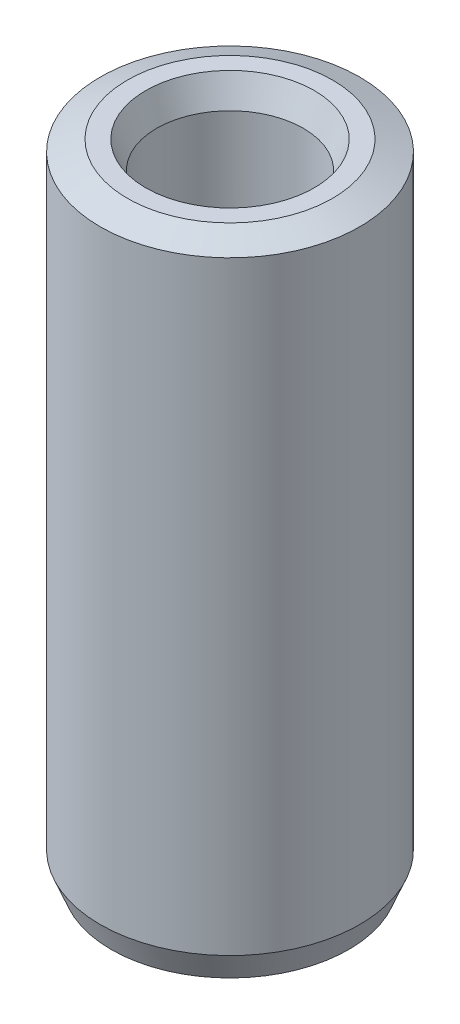
ISO-10303-21;
HEADER;
FILE_DESCRIPTION(('STEP AP214'),'2;1');
FILE_NAME('part.step','',(''),(''),'','','');
FILE_SCHEMA(('AUTOMOTIVE_DESIGN { 1 0 10303 214 1 1 1 1 }'));
ENDSEC;
DATA;
#1=APPLICATION_CONTEXT('core data for automotive mechanical design processes');
#2=APPLICATION_PROTOCOL_DEFINITION('international standard','automotive_design',2000,#1);
#3=PRODUCT_CONTEXT('',#1,'mechanical');
#4=PRODUCT('Part','Part','',(#3));
#5=PRODUCT_RELATED_PRODUCT_CATEGORY('part','',(#4));
#6=PRODUCT_DEFINITION_FORMATION('','',#4);
#7=PRODUCT_DEFINITION_CONTEXT('part definition',#1,'design');
#8=PRODUCT_DEFINITION('design','',#6,#7);
#9=PRODUCT_DEFINITION_SHAPE('','',#8);
#10=(LENGTH_UNIT() NAMED_UNIT(*) SI_UNIT(.MILLI.,.METRE.));
#11=(NAMED_UNIT(*) PLANE_ANGLE_UNIT() SI_UNIT($,.RADIAN.));
#12=(NAMED_UNIT(*) SI_UNIT($,.STERADIAN.) SOLID_ANGLE_UNIT());
#13=UNCERTAINTY_MEASURE_WITH_UNIT(LENGTH_MEASURE(1.E-05),#10,'distance_accuracy_value','');
#14=(GEOMETRIC_REPRESENTATION_CONTEXT(3) GLOBAL_UNCERTAINTY_ASSIGNED_CONTEXT((#13)) GLOBAL_UNIT_ASSIGNED_CONTEXT((#10,
#11,#12)) REPRESENTATION_CONTEXT('',''));
#15=CARTESIAN_POINT('',(0.,0.,0.));
#16=DIRECTION('',(0.,0.,1.));
#17=DIRECTION('',(1.,0.,0.));
#18=AXIS2_PLACEMENT_3D('',#15,#16,#17);
#19=CARTESIAN_POINT('',(0.,210.453476227582,0.));
#20=DIRECTION('',(0.,-1.,0.));
#21=DIRECTION('',(0.,0.,-1.));
#22=AXIS2_PLACEMENT_3D('',#19,#20,#21);
#23=CYLINDRICAL_SURFACE('',#22,42.5);
#24=CARTESIAN_POINT('',(0.,8.90464773771635,0.));
#25=DIRECTION('',(0.,1.,0.));
#26=DIRECTION('',(0.,0.,1.));
#27=AXIS2_PLACEMENT_3D('',#24,#25,#26);
#28=CIRCLE('',#27,42.5);
#29=CARTESIAN_POINT('',(0.,8.90464773771635,42.5));
#30=VERTEX_POINT('',#29);
#31=EDGE_CURVE('E10',#30,#30,#28,.T.);
#32=ORIENTED_EDGE('',*,*,#31,.T.);
#33=EDGE_LOOP('',(#32));
#34=FACE_BOUND('',#33,.T.);
#35=CARTESIAN_POINT('',(0.,206.84951135065,0.));
#36=DIRECTION('',(0.,1.,0.));
#37=DIRECTION('',(0.,0.,1.));
#38=AXIS2_PLACEMENT_3D('',#35,#36,#37);
#39=CIRCLE('',#38,42.5);
#40=CARTESIAN_POINT('',(0.,206.84951135065,-42.5));
#41=VERTEX_POINT('',#40);
#42=EDGE_CURVE('E50',#41,#41,#39,.F.);
#43=ORIENTED_EDGE('',*,*,#42,.T.);
#44=EDGE_LOOP('',(#43));
#45=FACE_BOUND('',#44,.T.);
#46=ADVANCED_FACE('F39',(#34,#45),#23,.T.);
#47=CARTESIAN_POINT('',(0.,210.453476227582,0.));
#48=DIRECTION('',(0.,1.,0.));
#49=DIRECTION('',(0.,0.,1.));
#50=AXIS2_PLACEMENT_3D('',#47,#48,#49);
#51=PLANE('',#50);
#52=CARTESIAN_POINT('',(0.,210.453476227582,0.));
#53=DIRECTION('',(0.,1.,0.));
#54=DIRECTION('',(0.,0.,1.));
#55=AXIS2_PLACEMENT_3D('',#52,#53,#54);
#56=CIRCLE('',#55,27.6134441037123);
#57=CARTESIAN_POINT('',(0.,210.453476227582,27.6134441037123));
#58=VERTEX_POINT('',#57);
#59=EDGE_CURVE('E58',#58,#58,#56,.F.);
#60=ORIENTED_EDGE('',*,*,#59,.T.);
#61=EDGE_LOOP('',(#60));
#62=FACE_BOUND('',#61,.T.);
#63=CARTESIAN_POINT('',(0.,210.453476227582,0.));
#64=DIRECTION('',(0.,1.,0.));
#65=DIRECTION('',(0.,0.,1.));
#66=AXIS2_PLACEMENT_3D('',#63,#64,#65);
#67=CIRCLE('',#66,33.5953522622835);
#68=CARTESIAN_POINT('',(0.,210.453476227582,-33.5953522622836));
#69=VERTEX_POINT('',#68);
#70=EDGE_CURVE('E61',#69,#69,#67,.T.);
#71=ORIENTED_EDGE('',*,*,#70,.T.);
#72=EDGE_LOOP('',(#71));
#73=FACE_BOUND('',#72,.T.);
#74=ADVANCED_FACE('F88',(#62,#73),#51,.T.);
#75=CARTESIAN_POINT('',(0.,0.,0.));
#76=DIRECTION('',(0.,1.,0.));
#77=DIRECTION('',(0.,0.,1.));
#78=AXIS2_PLACEMENT_3D('',#75,#76,#77);
#79=PLANE('',#78);
#80=CARTESIAN_POINT('',(0.,0.,0.));
#81=DIRECTION('',(0.,1.,0.));
#82=DIRECTION('',(0.,0.,1.));
#83=AXIS2_PLACEMENT_3D('',#80,#81,#82);
#84=CIRCLE('',#83,32.9141269644972);
#85=CARTESIAN_POINT('',(0.,0.,-32.9141269644972));
#86=VERTEX_POINT('',#85);
#87=EDGE_CURVE('E51',#86,#86,#84,.T.);
#88=ORIENTED_EDGE('',*,*,#87,.T.);
#89=EDGE_LOOP('',(#88));
#90=FACE_BOUND('',#89,.T.);
#91=CARTESIAN_POINT('',(0.,0.,0.));
#92=DIRECTION('',(0.,1.,0.));
#93=DIRECTION('',(0.,0.,1.));
#94=AXIS2_PLACEMENT_3D('',#91,#92,#93);
#95=CIRCLE('',#94,38.8960351230685);
#96=CARTESIAN_POINT('',(0.,0.,38.8960351230685));
#97=VERTEX_POINT('',#96);
#98=EDGE_CURVE('E54',#97,#97,#95,.F.);
#99=ORIENTED_EDGE('',*,*,#98,.T.);
#100=EDGE_LOOP('',(#99));
#101=FACE_BOUND('',#100,.T.);
#102=ADVANCED_FACE('F83',(#90,#101),#79,.F.);
#103=CARTESIAN_POINT('',(0.,210.453476227582,0.));
#104=DIRECTION('',(0.,-1.,0.));
#105=DIRECTION('',(0.,0.,-1.));
#106=AXIS2_PLACEMENT_3D('',#103,#104,#105);
#107=CYLINDRICAL_SURFACE('',#106,24.0094792267807);
#108=CARTESIAN_POINT('',(0.,201.548828489865,0.));
#109=DIRECTION('',(0.,1.,0.));
#110=DIRECTION('',(0.,0.,1.));
#111=AXIS2_PLACEMENT_3D('',#108,#109,#110);
#112=CIRCLE('',#111,24.0094792267807);
#113=CARTESIAN_POINT('',(0.,201.548828489865,24.0094792267807));
#114=VERTEX_POINT('',#113);
#115=EDGE_CURVE('E67',#114,#114,#112,.T.);
#116=ORIENTED_EDGE('',*,*,#115,.T.);
#117=EDGE_LOOP('',(#116));
#118=FACE_BOUND('',#117,.T.);
#119=CARTESIAN_POINT('',(0.,3.6039648769316,0.));
#120=DIRECTION('',(0.,1.,0.));
#121=DIRECTION('',(0.,0.,1.));
#122=AXIS2_PLACEMENT_3D('',#119,#120,#121);
#123=CIRCLE('',#122,24.0094792267807);
#124=CARTESIAN_POINT('',(0.,3.6039648769316,-24.0094792267807));
#125=VERTEX_POINT('',#124);
#126=EDGE_CURVE('E69',#125,#125,#123,.F.);
#127=ORIENTED_EDGE('',*,*,#126,.T.);
#128=EDGE_LOOP('',(#127));
#129=FACE_BOUND('',#128,.T.);
#130=ADVANCED_FACE('F71',(#118,#129),#107,.F.);
#131=CARTESIAN_POINT('',(0.,201.548828489865,0.));
#132=DIRECTION('',(0.,1.,0.));
#133=DIRECTION('',(0.,0.,1.));
#134=AXIS2_PLACEMENT_3D('',#131,#132,#133);
#135=CONICAL_SURFACE('',#134,24.0094792267807,0.384576027060333);
#136=ORIENTED_EDGE('',*,*,#59,.F.);
#137=EDGE_LOOP('',(#136));
#138=FACE_BOUND('',#137,.T.);
#139=ORIENTED_EDGE('',*,*,#115,.F.);
#140=EDGE_LOOP('',(#139));
#141=FACE_BOUND('',#140,.T.);
#142=ADVANCED_FACE('F77',(#138,#141),#135,.F.);
#143=CARTESIAN_POINT('',(0.,0.,0.));
#144=DIRECTION('',(0.,-1.,0.));
#145=DIRECTION('',(0.,0.,-1.));
#146=AXIS2_PLACEMENT_3D('',#143,#144,#145);
#147=CONICAL_SURFACE('',#146,32.9141269644972,1.18622029973456);
#148=CARTESIAN_POINT('',(0.,3.6039648769316,-24.0094792267807));
#149=CARTESIAN_POINT('',(0.,3.56642357613023,-24.1022359740486));
#150=CARTESIAN_POINT('',(0.,3.52888227532886,-24.1949927213165));
#151=CARTESIAN_POINT('',(0.,3.45379967372611,-24.3805062158522));
#152=CARTESIAN_POINT('',(0.,3.41625837292474,-24.4732629631201));
#153=CARTESIAN_POINT('',(0.,3.341175771322,-24.6587764576559));
#154=CARTESIAN_POINT('',(0.,3.30363447052063,-24.7515332049237));
#155=CARTESIAN_POINT('',(0.,3.22855186891789,-24.9370466994595));
#156=CARTESIAN_POINT('',(0.,3.19101056811652,-25.0298034467274));
#157=CARTESIAN_POINT('',(0.,3.11592796651378,-25.2153169412631));
#158=CARTESIAN_POINT('',(0.,3.07838666571241,-25.308073688531));
#159=CARTESIAN_POINT('',(0.,3.00330406410966,-25.4935871830668));
#160=CARTESIAN_POINT('',(0.,2.96576276330829,-25.5863439303347));
#161=CARTESIAN_POINT('',(0.,2.89068016170555,-25.7718574248704));
#162=CARTESIAN_POINT('',(0.,2.85313886090418,-25.8646141721383));
#163=CARTESIAN_POINT('',(0.,2.77805625930144,-26.0501276666741));
#164=CARTESIAN_POINT('',(0.,2.74051495850007,-26.1428844139419));
#165=CARTESIAN_POINT('',(0.,2.66543235689733,-26.3283979084777));
#166=CARTESIAN_POINT('',(0.,2.62789105609596,-26.4211546557456));
#167=CARTESIAN_POINT('',(0.,2.55280845449321,-26.6066681502813));
#168=CARTESIAN_POINT('',(0.,2.51526715369184,-26.6994248975492));
#169=CARTESIAN_POINT('',(0.,2.4401845520891,-26.884938392085));
#170=CARTESIAN_POINT('',(0.,2.40264325128773,-26.9776951393529));
#171=CARTESIAN_POINT('',(0.,2.32756064968499,-27.1632086338886));
#172=CARTESIAN_POINT('',(0.,2.29001934888362,-27.2559653811565));
#173=CARTESIAN_POINT('',(0.,2.21493674728088,-27.4414788756923));
#174=CARTESIAN_POINT('',(0.,2.17739544647951,-27.5342356229601));
#175=CARTESIAN_POINT('',(0.,2.10231284487677,-27.7197491174959));
#176=CARTESIAN_POINT('',(0.,2.06477154407539,-27.8125058647638));
#177=CARTESIAN_POINT('',(0.,1.98968894247265,-27.9980193592995));
#178=CARTESIAN_POINT('',(0.,1.95214764167128,-28.0907761065674));
#179=CARTESIAN_POINT('',(0.,1.87706504006854,-28.2762896011032));
#180=CARTESIAN_POINT('',(0.,1.83952373926717,-28.3690463483711));
#181=CARTESIAN_POINT('',(0.,1.76444113766443,-28.5545598429068));
#182=CARTESIAN_POINT('',(0.,1.72689983686306,-28.6473165901747));
#183=CARTESIAN_POINT('',(0.,1.65181723526032,-28.8328300847105));
#184=CARTESIAN_POINT('',(0.,1.61427593445894,-28.9255868319783));
#185=CARTESIAN_POINT('',(0.,1.5391933328562,-29.1111003265141));
#186=CARTESIAN_POINT('',(0.,1.50165203205483,-29.203857073782));
#187=CARTESIAN_POINT('',(0.,1.42656943045209,-29.3893705683177));
#188=CARTESIAN_POINT('',(0.,1.38902812965072,-29.4821273155856));
#189=CARTESIAN_POINT('',(0.,1.31394552804798,-29.6676408101214));
#190=CARTESIAN_POINT('',(0.,1.27640422724661,-29.7603975573893));
#191=CARTESIAN_POINT('',(0.,1.20132162564387,-29.945911051925));
#192=CARTESIAN_POINT('',(0.,1.16378032484249,-30.0386677991929));
#193=CARTESIAN_POINT('',(0.,1.08869772323975,-30.2241812937286));
#194=CARTESIAN_POINT('',(0.,1.05115642243838,-30.3169380409965));
#195=CARTESIAN_POINT('',(0.,0.976073820835641,-30.5024515355323));
#196=CARTESIAN_POINT('',(0.,0.93853252003427,-30.5952082828002));
#197=CARTESIAN_POINT('',(0.,0.863449918431529,-30.7807217773359));
#198=CARTESIAN_POINT('',(0.,0.825908617630158,-30.8734785246038));
#199=CARTESIAN_POINT('',(0.,0.750826016027416,-31.0589920191396));
#200=CARTESIAN_POINT('',(0.,0.713284715226045,-31.1517487664074));
#201=CARTESIAN_POINT('',(0.,0.638202113623303,-31.3372622609432));
#202=CARTESIAN_POINT('',(0.,0.600660812821933,-31.4300190082111));
#203=CARTESIAN_POINT('',(0.,0.525578211219191,-31.6155325027468));
#204=CARTESIAN_POINT('',(0.,0.48803691041782,-31.7082892500147));
#205=CARTESIAN_POINT('',(0.,0.412954308815079,-31.8938027445505));
#206=CARTESIAN_POINT('',(0.,0.375413008013708,-31.9865594918184));
#207=CARTESIAN_POINT('',(0.,0.300330406410967,-32.1720729863541));
#208=CARTESIAN_POINT('',(0.,0.262789105609595,-32.264829733622));
#209=CARTESIAN_POINT('',(0.,0.187706504006854,-32.4503432281578));
#210=CARTESIAN_POINT('',(0.,0.150165203205483,-32.5430999754256));
#211=CARTESIAN_POINT('',(0.,0.0750826016027425,-32.7286134699614));
#212=CARTESIAN_POINT('',(0.,0.0375413008013721,-32.8213702172293));
#213=CARTESIAN_POINT('',(0.,0.,-32.9141269644972));
#214=B_SPLINE_CURVE_WITH_KNOTS('',3,(#148,#149,#150,#151,#152,#153,#154,#155,#156,#157,#158,
#159,#160,#161,#162,#163,#164,#165,#166,#167,#168,#169,#170,#171,#172,#173,#174,#175,#176,#177,
#178,#179,#180,#181,#182,#183,#184,#185,#186,#187,#188,#189,#190,#191,#192,#193,#194,#195,#196,
#197,#198,#199,#200,#201,#202,#203,#204,#205,#206,#207,#208,#209,#210,#211,#212,#213),
.UNSPECIFIED.,.F.,.F.,(4,2,2,2,2,2,2,2,2,2,2,2,2,2,2,2,2,2,2,2,2,2,2,2,2,2,2,2,2,2,2,2,4),(0.,
0.300197386507923,0.600394773015846,0.90059215952377,1.20078954603169,1.50098693253961,
1.80118431904754,2.10138170555546,2.40157909206338,2.7017764785713,3.00197386507923,
3.30217125158715,3.60236863809507,3.90256602460299,4.20276341111092,4.50296079761884,
4.80315818412676,5.10335557063468,5.4035529571426,5.70375034365053,6.00394773015845,
6.30414511666637,6.60434250317429,6.90453988968222,7.20473727619014,7.50493466269806,
7.80513204920598,8.10532943571391,8.40552682222183,8.70572420872975,9.00592159523767,
9.3061189817456,9.60631636825352),.UNSPECIFIED.);
#215=EDGE_CURVE('BSEAM73',#125,#86,#214,.T.);
#216=ORIENTED_EDGE('',*,*,#126,.F.);
#217=ORIENTED_EDGE('',*,*,#87,.F.);
#218=ORIENTED_EDGE('',*,*,#215,.T.);
#219=ORIENTED_EDGE('',*,*,#215,.F.);
#220=EDGE_LOOP('',(#216,#218,#217,#219));
#221=FACE_BOUND('',#220,.T.);
#222=ADVANCED_FACE('F73',(#221),#147,.F.);
#223=CARTESIAN_POINT('',(0.,8.90464773771635,0.));
#224=DIRECTION('',(0.,1.,0.));
#225=DIRECTION('',(0.,0.,1.));
#226=AXIS2_PLACEMENT_3D('',#223,#224,#225);
#227=CONICAL_SURFACE('',#226,42.5,0.384576027060336);
#228=ORIENTED_EDGE('',*,*,#98,.F.);
#229=EDGE_LOOP('',(#228));
#230=FACE_BOUND('',#229,.T.);
#231=ORIENTED_EDGE('',*,*,#31,.F.);
#232=EDGE_LOOP('',(#231));
#233=FACE_BOUND('',#232,.T.);
#234=ADVANCED_FACE('F76',(#230,#233),#227,.T.);
#235=CARTESIAN_POINT('',(0.,210.453476227582,0.));
#236=DIRECTION('',(0.,-1.,0.));
#237=DIRECTION('',(0.,0.,-1.));
#238=AXIS2_PLACEMENT_3D('',#235,#236,#237);
#239=CONICAL_SURFACE('',#238,33.5953522622835,1.18622029973456);
#240=CARTESIAN_POINT('',(0.,206.84951135065,-42.5));
#241=CARTESIAN_POINT('',(0.,206.887052651451,-42.4072432527322));
#242=CARTESIAN_POINT('',(0.,206.924593952253,-42.3144865054643));
#243=CARTESIAN_POINT('',(0.,206.999676553855,-42.1289730109285));
#244=CARTESIAN_POINT('',(0.,207.037217854657,-42.0362162636606));
#245=CARTESIAN_POINT('',(0.,207.11230045626,-41.8507027691249));
#246=CARTESIAN_POINT('',(0.,207.149841757061,-41.757946021857));
#247=CARTESIAN_POINT('',(0.,207.224924358664,-41.5724325273212));
#248=CARTESIAN_POINT('',(0.,207.262465659465,-41.4796757800534));
#249=CARTESIAN_POINT('',(0.,207.337548261068,-41.2941622855176));
#250=CARTESIAN_POINT('',(0.,207.375089561869,-41.2014055382497));
#251=CARTESIAN_POINT('',(0.,207.450172163472,-41.015892043714));
#252=CARTESIAN_POINT('',(0.,207.487713464273,-40.9231352964461));
#253=CARTESIAN_POINT('',(0.,207.562796065876,-40.7376218019103));
#254=CARTESIAN_POINT('',(0.,207.600337366677,-40.6448650546425));
#255=CARTESIAN_POINT('',(0.,207.67541996828,-40.4593515601067));
#256=CARTESIAN_POINT('',(0.,207.712961269081,-40.3665948128388));
#257=CARTESIAN_POINT('',(0.,207.788043870684,-40.1810813183031));
#258=CARTESIAN_POINT('',(0.,207.825585171486,-40.0883245710352));
#259=CARTESIAN_POINT('',(0.,207.900667773088,-39.9028110764994));
#260=CARTESIAN_POINT('',(0.,207.93820907389,-39.8100543292315));
#261=CARTESIAN_POINT('',(0.,208.013291675492,-39.6245408346958));
#262=CARTESIAN_POINT('',(0.,208.050832976294,-39.5317840874279));
#263=CARTESIAN_POINT('',(0.,208.125915577897,-39.3462705928921));
#264=CARTESIAN_POINT('',(0.,208.163456878698,-39.2535138456242));
#265=CARTESIAN_POINT('',(0.,208.238539480301,-39.0680003510885));
#266=CARTESIAN_POINT('',(0.,208.276080781102,-38.9752436038206));
#267=CARTESIAN_POINT('',(0.,208.351163382705,-38.7897301092849));
#268=CARTESIAN_POINT('',(0.,208.388704683506,-38.696973362017));
#269=CARTESIAN_POINT('',(0.,208.463787285109,-38.5114598674812));
#270=CARTESIAN_POINT('',(0.,208.50132858591,-38.4187031202133));
#271=CARTESIAN_POINT('',(0.,208.576411187513,-38.2331896256776));
#272=CARTESIAN_POINT('',(0.,208.613952488314,-38.1404328784097));
#273=CARTESIAN_POINT('',(0.,208.689035089917,-37.9549193838739));
#274=CARTESIAN_POINT('',(0.,208.726576390718,-37.8621626366061));
#275=CARTESIAN_POINT('',(0.,208.801658992321,-37.6766491420703));
#276=CARTESIAN_POINT('',(0.,208.839200293123,-37.5838923948024));
#277=CARTESIAN_POINT('',(0.,208.914282894725,-37.3983789002667));
#278=CARTESIAN_POINT('',(0.,208.951824195527,-37.3056221529988));
#279=CARTESIAN_POINT('',(0.,209.026906797129,-37.120108658463));
#280=CARTESIAN_POINT('',(0.,209.064448097931,-37.0273519111951));
#281=CARTESIAN_POINT('',(0.,209.139530699534,-36.8418384166594));
#282=CARTESIAN_POINT('',(0.,209.177072000335,-36.7490816693915));
#283=CARTESIAN_POINT('',(0.,209.252154601938,-36.5635681748557));
#284=CARTESIAN_POINT('',(0.,209.289695902739,-36.4708114275879));
#285=CARTESIAN_POINT('',(0.,209.364778504342,-36.2852979330521));
#286=CARTESIAN_POINT('',(0.,209.402319805143,-36.1925411857842));
#287=CARTESIAN_POINT('',(0.,209.477402406746,-36.0070276912485));
#288=CARTESIAN_POINT('',(0.,209.514943707547,-35.9142709439806));
#289=CARTESIAN_POINT('',(0.,209.59002630915,-35.7287574494448));
#290=CARTESIAN_POINT('',(0.,209.627567609951,-35.6360007021769));
#291=CARTESIAN_POINT('',(0.,209.702650211554,-35.4504872076412));
#292=CARTESIAN_POINT('',(0.,209.740191512355,-35.3577304603733));
#293=CARTESIAN_POINT('',(0.,209.815274113958,-35.1722169658375));
#294=CARTESIAN_POINT('',(0.,209.85281541476,-35.0794602185697));
#295=CARTESIAN_POINT('',(0.,209.927898016362,-34.8939467240339));
#296=CARTESIAN_POINT('',(0.,209.965439317164,-34.801189976766));
#297=CARTESIAN_POINT('',(0.,210.040521918766,-34.6156764822303));
#298=CARTESIAN_POINT('',(0.,210.078063219568,-34.5229197349624));
#299=CARTESIAN_POINT('',(0.,210.153145821171,-34.3374062404266));
#300=CARTESIAN_POINT('',(0.,210.190687121972,-34.2446494931587));
#301=CARTESIAN_POINT('',(0.,210.265769723575,-34.059135998623));
#302=CARTESIAN_POINT('',(0.,210.303311024376,-33.9663792513551));
#303=CARTESIAN_POINT('',(0.,210.378393625979,-33.7808657568193));
#304=CARTESIAN_POINT('',(0.,210.41593492678,-33.6881090095515));
#305=CARTESIAN_POINT('',(0.,210.453476227582,-33.5953522622836));
#306=B_SPLINE_CURVE_WITH_KNOTS('',3,(#240,#241,#242,#243,#244,#245,#246,#247,#248,#249,#250,
#251,#252,#253,#254,#255,#256,#257,#258,#259,#260,#261,#262,#263,#264,#265,#266,#267,#268,#269,
#270,#271,#272,#273,#274,#275,#276,#277,#278,#279,#280,#281,#282,#283,#284,#285,#286,#287,#288,
#289,#290,#291,#292,#293,#294,#295,#296,#297,#298,#299,#300,#301,#302,#303,#304,#305),
.UNSPECIFIED.,.F.,.F.,(4,2,2,2,2,2,2,2,2,2,2,2,2,2,2,2,2,2,2,2,2,2,2,2,2,2,2,2,2,2,2,2,4),(0.,
0.300197386507926,0.600394773015849,0.900592159523775,1.20078954603169,1.50098693253961,
1.80118431904754,2.10138170555546,2.40157909206338,2.70177647857131,3.00197386507922,
3.30217125158716,3.60236863809508,3.90256602460299,4.20276341111092,4.50296079761884,
4.80315818412676,5.10335557063469,5.40355295714261,5.70375034365054,6.00394773015845,
6.30414511666637,6.6043425031743,6.90453988968222,7.20473727619015,7.50493466269806,
7.80513204920599,8.10532943571391,8.40552682222184,8.70572420872975,9.00592159523768,
9.3061189817456,9.60631636825353),.UNSPECIFIED.);
#307=EDGE_CURVE('BSEAM45',#41,#69,#306,.T.);
#308=ORIENTED_EDGE('',*,*,#42,.F.);
#309=ORIENTED_EDGE('',*,*,#70,.F.);
#310=ORIENTED_EDGE('',*,*,#307,.T.);
#311=ORIENTED_EDGE('',*,*,#307,.F.);
#312=EDGE_LOOP('',(#308,#310,#309,#311));
#313=FACE_BOUND('',#312,.T.);
#314=ADVANCED_FACE('F45',(#313),#239,.T.);
#315=CLOSED_SHELL('',(#46,#74,#102,#130,#142,#222,#234,#314));
#316=MANIFOLD_SOLID_BREP('B2',#315);
#317=ADVANCED_BREP_SHAPE_REPRESENTATION('',(#18,#316),#14);
#318=SHAPE_DEFINITION_REPRESENTATION(#9,#317);
ENDSEC;
END-ISO-10303-21;
